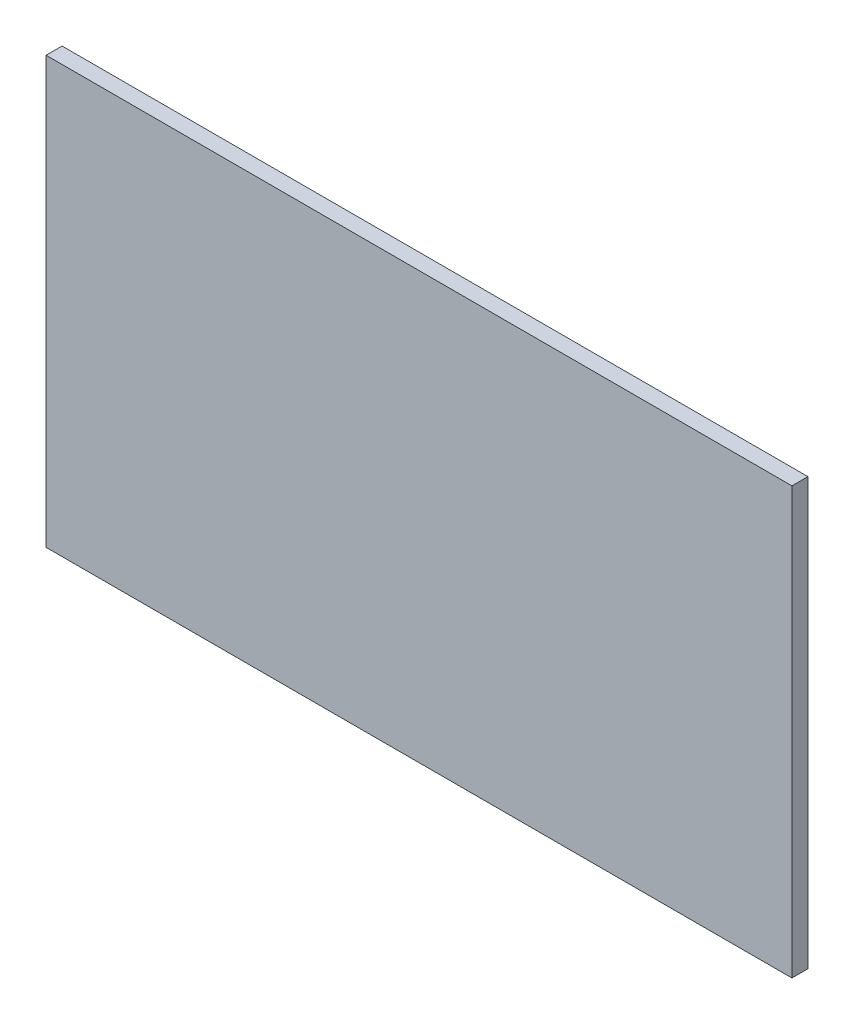
ISO-10303-21;
HEADER;
FILE_DESCRIPTION(('STEP AP214'),'2;1');
FILE_NAME('part.step','',(''),(''),'','','');
FILE_SCHEMA(('AUTOMOTIVE_DESIGN { 1 0 10303 214 1 1 1 1 }'));
ENDSEC;
DATA;
#1=APPLICATION_CONTEXT('core data for automotive mechanical design processes');
#2=APPLICATION_PROTOCOL_DEFINITION('international standard','automotive_design',2000,#1);
#3=PRODUCT_CONTEXT('',#1,'mechanical');
#4=PRODUCT('Part','Part','',(#3));
#5=PRODUCT_RELATED_PRODUCT_CATEGORY('part','',(#4));
#6=PRODUCT_DEFINITION_FORMATION('','',#4);
#7=PRODUCT_DEFINITION_CONTEXT('part definition',#1,'design');
#8=PRODUCT_DEFINITION('design','',#6,#7);
#9=PRODUCT_DEFINITION_SHAPE('','',#8);
#10=(LENGTH_UNIT() NAMED_UNIT(*) SI_UNIT(.MILLI.,.METRE.));
#11=(NAMED_UNIT(*) PLANE_ANGLE_UNIT() SI_UNIT($,.RADIAN.));
#12=(NAMED_UNIT(*) SI_UNIT($,.STERADIAN.) SOLID_ANGLE_UNIT());
#13=UNCERTAINTY_MEASURE_WITH_UNIT(LENGTH_MEASURE(1.E-05),#10,'distance_accuracy_value','');
#14=(GEOMETRIC_REPRESENTATION_CONTEXT(3) GLOBAL_UNCERTAINTY_ASSIGNED_CONTEXT((#13)) GLOBAL_UNIT_ASSIGNED_CONTEXT((#10,
#11,#12)) REPRESENTATION_CONTEXT('',''));
#15=CARTESIAN_POINT('',(0.,0.,0.));
#16=DIRECTION('',(0.,0.,1.));
#17=DIRECTION('',(1.,0.,0.));
#18=AXIS2_PLACEMENT_3D('',#15,#16,#17);
#19=CARTESIAN_POINT('',(0.,0.,3.));
#20=DIRECTION('',(1.,0.,0.));
#21=DIRECTION('',(0.,1.,0.));
#22=AXIS2_PLACEMENT_3D('',#19,#20,#21);
#23=PLANE('',#22);
#24=DIRECTION('',(0.,-1.,0.));
#25=VECTOR('',#24,1.);
#26=CARTESIAN_POINT('',(0.,0.,0.));
#27=LINE('',#26,#25);
#28=CARTESIAN_POINT('',(0.,0.,0.));
#29=VERTEX_POINT('',#28);
#30=CARTESIAN_POINT('',(0.,-80.,0.));
#31=VERTEX_POINT('',#30);
#32=EDGE_CURVE('E95',#29,#31,#27,.T.);
#33=ORIENTED_EDGE('',*,*,#32,.T.);
#34=DIRECTION('',(0.,0.,-1.));
#35=VECTOR('',#34,1.);
#36=CARTESIAN_POINT('',(0.,-80.,3.));
#37=LINE('',#36,#35);
#38=CARTESIAN_POINT('',(0.,-80.,3.));
#39=VERTEX_POINT('',#38);
#40=EDGE_CURVE('E11',#39,#31,#37,.T.);
#41=ORIENTED_EDGE('',*,*,#40,.F.);
#42=DIRECTION('',(0.,-1.,0.));
#43=VECTOR('',#42,1.);
#44=CARTESIAN_POINT('',(0.,0.,3.));
#45=LINE('',#44,#43);
#46=CARTESIAN_POINT('',(0.,0.,3.));
#47=VERTEX_POINT('',#46);
#48=EDGE_CURVE('E83',#47,#39,#45,.T.);
#49=ORIENTED_EDGE('',*,*,#48,.F.);
#50=DIRECTION('',(0.,0.,-1.));
#51=VECTOR('',#50,1.);
#52=CARTESIAN_POINT('',(0.,0.,3.));
#53=LINE('',#52,#51);
#54=EDGE_CURVE('E91',#47,#29,#53,.T.);
#55=ORIENTED_EDGE('',*,*,#54,.T.);
#56=EDGE_LOOP('',(#33,#41,#49,#55));
#57=FACE_BOUND('',#56,.T.);
#58=ADVANCED_FACE('F32',(#57),#23,.F.);
#59=CARTESIAN_POINT('',(0.,-80.,3.));
#60=DIRECTION('',(0.,1.,0.));
#61=DIRECTION('',(0.,0.,1.));
#62=AXIS2_PLACEMENT_3D('',#59,#60,#61);
#63=PLANE('',#62);
#64=DIRECTION('',(1.,0.,0.));
#65=VECTOR('',#64,1.);
#66=CARTESIAN_POINT('',(0.,-80.,0.));
#67=LINE('',#66,#65);
#68=CARTESIAN_POINT('',(140.,-80.,0.));
#69=VERTEX_POINT('',#68);
#70=EDGE_CURVE('E87',#31,#69,#67,.T.);
#71=ORIENTED_EDGE('',*,*,#70,.T.);
#72=DIRECTION('',(0.,0.,-1.));
#73=VECTOR('',#72,1.);
#74=CARTESIAN_POINT('',(140.,-80.,3.));
#75=LINE('',#74,#73);
#76=CARTESIAN_POINT('',(140.,-80.,3.));
#77=VERTEX_POINT('',#76);
#78=EDGE_CURVE('E40',#77,#69,#75,.T.);
#79=ORIENTED_EDGE('',*,*,#78,.F.);
#80=DIRECTION('',(1.,0.,0.));
#81=VECTOR('',#80,1.);
#82=CARTESIAN_POINT('',(0.,-80.,3.));
#83=LINE('',#82,#81);
#84=EDGE_CURVE('E78',#39,#77,#83,.T.);
#85=ORIENTED_EDGE('',*,*,#84,.F.);
#86=ORIENTED_EDGE('',*,*,#40,.T.);
#87=EDGE_LOOP('',(#71,#79,#85,#86));
#88=FACE_BOUND('',#87,.T.);
#89=ADVANCED_FACE('F86',(#88),#63,.F.);
#90=CARTESIAN_POINT('',(140.,0.,3.));
#91=DIRECTION('',(-1.,0.,0.));
#92=DIRECTION('',(0.,0.,1.));
#93=AXIS2_PLACEMENT_3D('',#90,#91,#92);
#94=PLANE('',#93);
#95=DIRECTION('',(0.,1.,0.));
#96=VECTOR('',#95,1.);
#97=CARTESIAN_POINT('',(140.,0.,0.));
#98=LINE('',#97,#96);
#99=CARTESIAN_POINT('',(140.,0.,0.));
#100=VERTEX_POINT('',#99);
#101=EDGE_CURVE('E65',#69,#100,#98,.T.);
#102=ORIENTED_EDGE('',*,*,#101,.T.);
#103=DIRECTION('',(0.,0.,-1.));
#104=VECTOR('',#103,1.);
#105=CARTESIAN_POINT('',(140.,0.,3.));
#106=LINE('',#105,#104);
#107=CARTESIAN_POINT('',(140.,0.,3.));
#108=VERTEX_POINT('',#107);
#109=EDGE_CURVE('E88',#108,#100,#106,.T.);
#110=ORIENTED_EDGE('',*,*,#109,.F.);
#111=DIRECTION('',(0.,1.,0.));
#112=VECTOR('',#111,1.);
#113=CARTESIAN_POINT('',(140.,0.,3.));
#114=LINE('',#113,#112);
#115=EDGE_CURVE('E81',#77,#108,#114,.T.);
#116=ORIENTED_EDGE('',*,*,#115,.F.);
#117=ORIENTED_EDGE('',*,*,#78,.T.);
#118=EDGE_LOOP('',(#102,#110,#116,#117));
#119=FACE_BOUND('',#118,.T.);
#120=ADVANCED_FACE('F89',(#119),#94,.F.);
#121=CARTESIAN_POINT('',(0.,0.,3.));
#122=DIRECTION('',(0.,-1.,0.));
#123=DIRECTION('',(0.,0.,-1.));
#124=AXIS2_PLACEMENT_3D('',#121,#122,#123);
#125=PLANE('',#124);
#126=DIRECTION('',(-1.,0.,0.));
#127=VECTOR('',#126,1.);
#128=CARTESIAN_POINT('',(0.,0.,0.));
#129=LINE('',#128,#127);
#130=EDGE_CURVE('E71',#100,#29,#129,.T.);
#131=ORIENTED_EDGE('',*,*,#130,.T.);
#132=ORIENTED_EDGE('',*,*,#54,.F.);
#133=DIRECTION('',(-1.,0.,0.));
#134=VECTOR('',#133,1.);
#135=CARTESIAN_POINT('',(0.,0.,3.));
#136=LINE('',#135,#134);
#137=EDGE_CURVE('E48',#108,#47,#136,.T.);
#138=ORIENTED_EDGE('',*,*,#137,.F.);
#139=ORIENTED_EDGE('',*,*,#109,.T.);
#140=EDGE_LOOP('',(#131,#132,#138,#139));
#141=FACE_BOUND('',#140,.T.);
#142=ADVANCED_FACE('F102',(#141),#125,.F.);
#143=CARTESIAN_POINT('',(0.,0.,3.));
#144=DIRECTION('',(0.,0.,1.));
#145=DIRECTION('',(1.,0.,0.));
#146=AXIS2_PLACEMENT_3D('',#143,#144,#145);
#147=PLANE('',#146);
#148=ORIENTED_EDGE('',*,*,#48,.T.);
#149=ORIENTED_EDGE('',*,*,#84,.T.);
#150=ORIENTED_EDGE('',*,*,#115,.T.);
#151=ORIENTED_EDGE('',*,*,#137,.T.);
#152=EDGE_LOOP('',(#148,#149,#150,#151));
#153=FACE_BOUND('',#152,.T.);
#154=ADVANCED_FACE('F79',(#153),#147,.T.);
#155=CARTESIAN_POINT('',(0.,0.,0.));
#156=DIRECTION('',(0.,0.,1.));
#157=DIRECTION('',(1.,0.,0.));
#158=AXIS2_PLACEMENT_3D('',#155,#156,#157);
#159=PLANE('',#158);
#160=ORIENTED_EDGE('',*,*,#32,.F.);
#161=ORIENTED_EDGE('',*,*,#130,.F.);
#162=ORIENTED_EDGE('',*,*,#101,.F.);
#163=ORIENTED_EDGE('',*,*,#70,.F.);
#164=EDGE_LOOP('',(#160,#161,#162,#163));
#165=FACE_BOUND('',#164,.T.);
#166=ADVANCED_FACE('F105',(#165),#159,.F.);
#167=CLOSED_SHELL('',(#58,#89,#120,#142,#154,#166));
#168=MANIFOLD_SOLID_BREP('B2',#167);
#169=ADVANCED_BREP_SHAPE_REPRESENTATION('',(#18,#168),#14);
#170=SHAPE_DEFINITION_REPRESENTATION(#9,#169);
ENDSEC;
END-ISO-10303-21;
